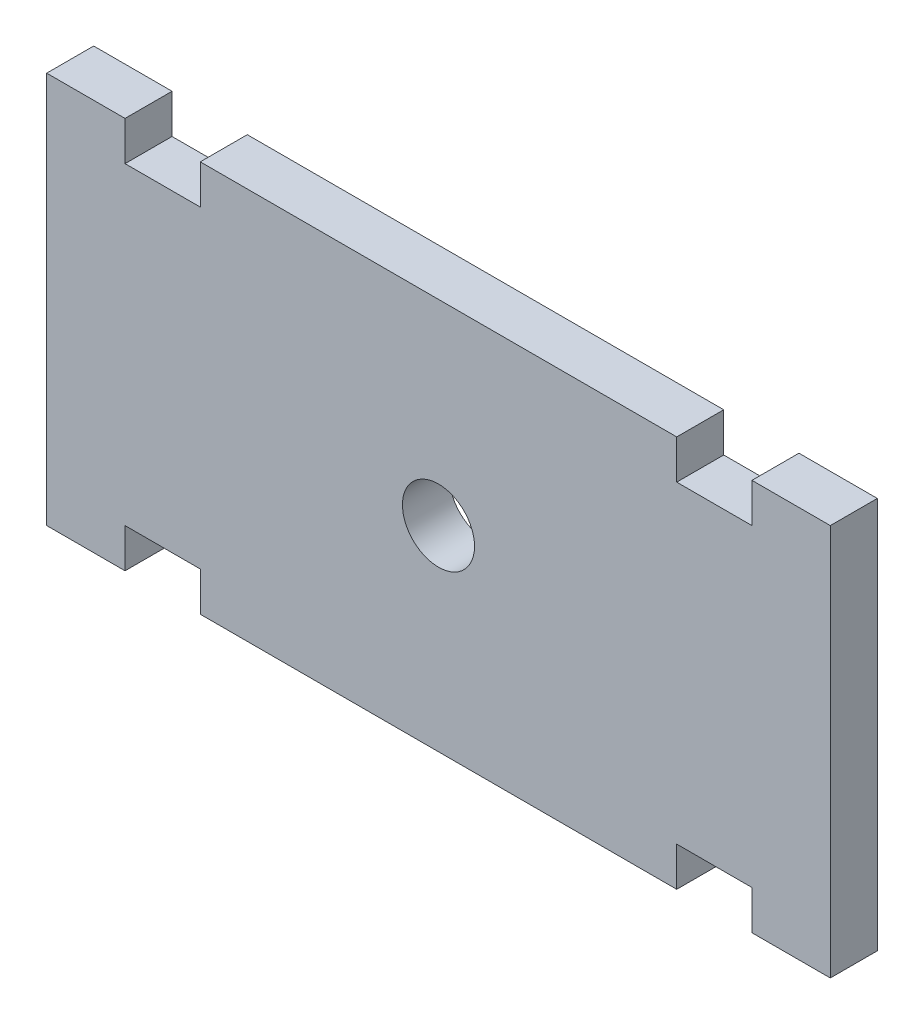
ISO-10303-21;
HEADER;
FILE_DESCRIPTION(('STEP AP214'),'2;1');
FILE_NAME('part.step','',(''),(''),'','','');
FILE_SCHEMA(('AUTOMOTIVE_DESIGN { 1 0 10303 214 1 1 1 1 }'));
ENDSEC;
DATA;
#1=APPLICATION_CONTEXT('core data for automotive mechanical design processes');
#2=APPLICATION_PROTOCOL_DEFINITION('international standard','automotive_design',2000,#1);
#3=PRODUCT_CONTEXT('',#1,'mechanical');
#4=PRODUCT('Part','Part','',(#3));
#5=PRODUCT_RELATED_PRODUCT_CATEGORY('part','',(#4));
#6=PRODUCT_DEFINITION_FORMATION('','',#4);
#7=PRODUCT_DEFINITION_CONTEXT('part definition',#1,'design');
#8=PRODUCT_DEFINITION('design','',#6,#7);
#9=PRODUCT_DEFINITION_SHAPE('','',#8);
#10=(LENGTH_UNIT() NAMED_UNIT(*) SI_UNIT(.MILLI.,.METRE.));
#11=(NAMED_UNIT(*) PLANE_ANGLE_UNIT() SI_UNIT($,.RADIAN.));
#12=(NAMED_UNIT(*) SI_UNIT($,.STERADIAN.) SOLID_ANGLE_UNIT());
#13=UNCERTAINTY_MEASURE_WITH_UNIT(LENGTH_MEASURE(1.E-05),#10,'distance_accuracy_value','');
#14=(GEOMETRIC_REPRESENTATION_CONTEXT(3) GLOBAL_UNCERTAINTY_ASSIGNED_CONTEXT((#13)) GLOBAL_UNIT_ASSIGNED_CONTEXT((#10,
#11,#12)) REPRESENTATION_CONTEXT('',''));
#15=CARTESIAN_POINT('',(0.,0.,0.));
#16=DIRECTION('',(0.,0.,1.));
#17=DIRECTION('',(1.,0.,0.));
#18=AXIS2_PLACEMENT_3D('',#15,#16,#17);
#19=CARTESIAN_POINT('',(-25.,12.5,-3.));
#20=DIRECTION('',(-1.,0.,0.));
#21=DIRECTION('',(0.,0.,1.));
#22=AXIS2_PLACEMENT_3D('',#19,#20,#21);
#23=PLANE('',#22);
#24=DIRECTION('',(0.,-1.,0.));
#25=VECTOR('',#24,1.);
#26=CARTESIAN_POINT('',(-25.,12.5,0.));
#27=LINE('',#26,#25);
#28=CARTESIAN_POINT('',(-25.,12.5,0.));
#29=VERTEX_POINT('',#28);
#30=CARTESIAN_POINT('',(-25.,-12.5,0.));
#31=VERTEX_POINT('',#30);
#32=EDGE_CURVE('E201',#29,#31,#27,.T.);
#33=ORIENTED_EDGE('',*,*,#32,.F.);
#34=DIRECTION('',(0.,0.,1.));
#35=VECTOR('',#34,1.);
#36=CARTESIAN_POINT('',(-25.,12.5,-3.));
#37=LINE('',#36,#35);
#38=CARTESIAN_POINT('',(-25.,12.5,-3.));
#39=VERTEX_POINT('',#38);
#40=EDGE_CURVE('E11',#39,#29,#37,.T.);
#41=ORIENTED_EDGE('',*,*,#40,.F.);
#42=DIRECTION('',(0.,-1.,0.));
#43=VECTOR('',#42,1.);
#44=CARTESIAN_POINT('',(-25.,12.5,-3.));
#45=LINE('',#44,#43);
#46=CARTESIAN_POINT('',(-25.,-12.5,-3.));
#47=VERTEX_POINT('',#46);
#48=EDGE_CURVE('E258',#39,#47,#45,.T.);
#49=ORIENTED_EDGE('',*,*,#48,.T.);
#50=DIRECTION('',(0.,0.,1.));
#51=VECTOR('',#50,1.);
#52=CARTESIAN_POINT('',(-25.,-12.5,-3.));
#53=LINE('',#52,#51);
#54=EDGE_CURVE('E35',#47,#31,#53,.T.);
#55=ORIENTED_EDGE('',*,*,#54,.T.);
#56=EDGE_LOOP('',(#33,#41,#49,#55));
#57=FACE_BOUND('',#56,.T.);
#58=ADVANCED_FACE('F32',(#57),#23,.T.);
#59=CARTESIAN_POINT('',(-25.,12.5,-3.));
#60=DIRECTION('',(0.,1.,0.));
#61=DIRECTION('',(0.,0.,1.));
#62=AXIS2_PLACEMENT_3D('',#59,#60,#61);
#63=PLANE('',#62);
#64=DIRECTION('',(-1.,0.,0.));
#65=VECTOR('',#64,1.);
#66=CARTESIAN_POINT('',(-25.,12.5,0.));
#67=LINE('',#66,#65);
#68=CARTESIAN_POINT('',(-20.,12.5,0.));
#69=VERTEX_POINT('',#68);
#70=EDGE_CURVE('E256',#69,#29,#67,.T.);
#71=ORIENTED_EDGE('',*,*,#70,.F.);
#72=DIRECTION('',(0.,0.,1.));
#73=VECTOR('',#72,1.);
#74=CARTESIAN_POINT('',(-20.,12.5,-3.));
#75=LINE('',#74,#73);
#76=CARTESIAN_POINT('',(-20.,12.5,-3.));
#77=VERTEX_POINT('',#76);
#78=EDGE_CURVE('E41',#77,#69,#75,.T.);
#79=ORIENTED_EDGE('',*,*,#78,.F.);
#80=DIRECTION('',(-1.,0.,0.));
#81=VECTOR('',#80,1.);
#82=CARTESIAN_POINT('',(-25.,12.5,-3.));
#83=LINE('',#82,#81);
#84=EDGE_CURVE('E191',#77,#39,#83,.T.);
#85=ORIENTED_EDGE('',*,*,#84,.T.);
#86=ORIENTED_EDGE('',*,*,#40,.T.);
#87=EDGE_LOOP('',(#71,#79,#85,#86));
#88=FACE_BOUND('',#87,.T.);
#89=ADVANCED_FACE('F294',(#88),#63,.T.);
#90=CARTESIAN_POINT('',(-20.,12.5,-3.));
#91=DIRECTION('',(1.,0.,0.));
#92=DIRECTION('',(0.,0.,-1.));
#93=AXIS2_PLACEMENT_3D('',#90,#91,#92);
#94=PLANE('',#93);
#95=DIRECTION('',(0.,1.,0.));
#96=VECTOR('',#95,1.);
#97=CARTESIAN_POINT('',(-20.,12.5,0.));
#98=LINE('',#97,#96);
#99=CARTESIAN_POINT('',(-20.,10.,0.));
#100=VERTEX_POINT('',#99);
#101=EDGE_CURVE('E178',#100,#69,#98,.T.);
#102=ORIENTED_EDGE('',*,*,#101,.F.);
#103=DIRECTION('',(0.,0.,1.));
#104=VECTOR('',#103,1.);
#105=CARTESIAN_POINT('',(-20.,10.,-3.));
#106=LINE('',#105,#104);
#107=CARTESIAN_POINT('',(-20.,10.,-3.));
#108=VERTEX_POINT('',#107);
#109=EDGE_CURVE('E173',#108,#100,#106,.T.);
#110=ORIENTED_EDGE('',*,*,#109,.F.);
#111=DIRECTION('',(0.,1.,0.));
#112=VECTOR('',#111,1.);
#113=CARTESIAN_POINT('',(-20.,12.5,-3.));
#114=LINE('',#113,#112);
#115=EDGE_CURVE('E176',#108,#77,#114,.T.);
#116=ORIENTED_EDGE('',*,*,#115,.T.);
#117=ORIENTED_EDGE('',*,*,#78,.T.);
#118=EDGE_LOOP('',(#102,#110,#116,#117));
#119=FACE_BOUND('',#118,.T.);
#120=ADVANCED_FACE('F175',(#119),#94,.T.);
#121=CARTESIAN_POINT('',(-20.,10.,-3.));
#122=DIRECTION('',(0.,1.,0.));
#123=DIRECTION('',(0.,0.,1.));
#124=AXIS2_PLACEMENT_3D('',#121,#122,#123);
#125=PLANE('',#124);
#126=DIRECTION('',(-1.,0.,0.));
#127=VECTOR('',#126,1.);
#128=CARTESIAN_POINT('',(-20.,10.,0.));
#129=LINE('',#128,#127);
#130=CARTESIAN_POINT('',(-15.2,10.,0.));
#131=VERTEX_POINT('',#130);
#132=EDGE_CURVE('E253',#131,#100,#129,.T.);
#133=ORIENTED_EDGE('',*,*,#132,.F.);
#134=DIRECTION('',(0.,0.,1.));
#135=VECTOR('',#134,1.);
#136=CARTESIAN_POINT('',(-15.2,10.,-3.));
#137=LINE('',#136,#135);
#138=CARTESIAN_POINT('',(-15.2,10.,-3.));
#139=VERTEX_POINT('',#138);
#140=EDGE_CURVE('E183',#139,#131,#137,.T.);
#141=ORIENTED_EDGE('',*,*,#140,.F.);
#142=DIRECTION('',(-1.,0.,0.));
#143=VECTOR('',#142,1.);
#144=CARTESIAN_POINT('',(-20.,10.,-3.));
#145=LINE('',#144,#143);
#146=EDGE_CURVE('E189',#139,#108,#145,.T.);
#147=ORIENTED_EDGE('',*,*,#146,.T.);
#148=ORIENTED_EDGE('',*,*,#109,.T.);
#149=EDGE_LOOP('',(#133,#141,#147,#148));
#150=FACE_BOUND('',#149,.T.);
#151=ADVANCED_FACE('F193',(#150),#125,.T.);
#152=CARTESIAN_POINT('',(-15.2,10.,-3.));
#153=DIRECTION('',(-1.,0.,0.));
#154=DIRECTION('',(0.,0.,1.));
#155=AXIS2_PLACEMENT_3D('',#152,#153,#154);
#156=PLANE('',#155);
#157=DIRECTION('',(0.,-1.,0.));
#158=VECTOR('',#157,1.);
#159=CARTESIAN_POINT('',(-15.2,10.,0.));
#160=LINE('',#159,#158);
#161=CARTESIAN_POINT('',(-15.2,12.5,0.));
#162=VERTEX_POINT('',#161);
#163=EDGE_CURVE('E250',#162,#131,#160,.T.);
#164=ORIENTED_EDGE('',*,*,#163,.F.);
#165=DIRECTION('',(0.,0.,1.));
#166=VECTOR('',#165,1.);
#167=CARTESIAN_POINT('',(-15.2,12.5,-3.));
#168=LINE('',#167,#166);
#169=CARTESIAN_POINT('',(-15.2,12.5,-3.));
#170=VERTEX_POINT('',#169);
#171=EDGE_CURVE('E262',#170,#162,#168,.T.);
#172=ORIENTED_EDGE('',*,*,#171,.F.);
#173=DIRECTION('',(0.,-1.,0.));
#174=VECTOR('',#173,1.);
#175=CARTESIAN_POINT('',(-15.2,10.,-3.));
#176=LINE('',#175,#174);
#177=EDGE_CURVE('E194',#170,#139,#176,.T.);
#178=ORIENTED_EDGE('',*,*,#177,.T.);
#179=ORIENTED_EDGE('',*,*,#140,.T.);
#180=EDGE_LOOP('',(#164,#172,#178,#179));
#181=FACE_BOUND('',#180,.T.);
#182=ADVANCED_FACE('F307',(#181),#156,.T.);
#183=CARTESIAN_POINT('',(-15.2,12.5,-3.));
#184=DIRECTION('',(0.,1.,0.));
#185=DIRECTION('',(-1.,0.,0.));
#186=AXIS2_PLACEMENT_3D('',#183,#184,#185);
#187=PLANE('',#186);
#188=DIRECTION('',(-1.,0.,0.));
#189=VECTOR('',#188,1.);
#190=CARTESIAN_POINT('',(-15.2,12.5,0.));
#191=LINE('',#190,#189);
#192=CARTESIAN_POINT('',(15.2,12.5,0.));
#193=VERTEX_POINT('',#192);
#194=EDGE_CURVE('E247',#193,#162,#191,.T.);
#195=ORIENTED_EDGE('',*,*,#194,.F.);
#196=DIRECTION('',(0.,0.,1.));
#197=VECTOR('',#196,1.);
#198=CARTESIAN_POINT('',(15.2,12.5,-3.));
#199=LINE('',#198,#197);
#200=CARTESIAN_POINT('',(15.2,12.5,-3.));
#201=VERTEX_POINT('',#200);
#202=EDGE_CURVE('E264',#201,#193,#199,.T.);
#203=ORIENTED_EDGE('',*,*,#202,.F.);
#204=DIRECTION('',(-1.,0.,0.));
#205=VECTOR('',#204,1.);
#206=CARTESIAN_POINT('',(-15.2,12.5,-3.));
#207=LINE('',#206,#205);
#208=EDGE_CURVE('E196',#201,#170,#207,.T.);
#209=ORIENTED_EDGE('',*,*,#208,.T.);
#210=ORIENTED_EDGE('',*,*,#171,.T.);
#211=EDGE_LOOP('',(#195,#203,#209,#210));
#212=FACE_BOUND('',#211,.T.);
#213=ADVANCED_FACE('F310',(#212),#187,.T.);
#214=CARTESIAN_POINT('',(15.2,10.,-3.));
#215=DIRECTION('',(1.,0.,0.));
#216=DIRECTION('',(0.,0.,-1.));
#217=AXIS2_PLACEMENT_3D('',#214,#215,#216);
#218=PLANE('',#217);
#219=DIRECTION('',(0.,1.,0.));
#220=VECTOR('',#219,1.);
#221=CARTESIAN_POINT('',(15.2,10.,0.));
#222=LINE('',#221,#220);
#223=CARTESIAN_POINT('',(15.2,10.,0.));
#224=VERTEX_POINT('',#223);
#225=EDGE_CURVE('E244',#224,#193,#222,.T.);
#226=ORIENTED_EDGE('',*,*,#225,.F.);
#227=DIRECTION('',(0.,0.,1.));
#228=VECTOR('',#227,1.);
#229=CARTESIAN_POINT('',(15.2,10.,-3.));
#230=LINE('',#229,#228);
#231=CARTESIAN_POINT('',(15.2,10.,-3.));
#232=VERTEX_POINT('',#231);
#233=EDGE_CURVE('E266',#232,#224,#230,.T.);
#234=ORIENTED_EDGE('',*,*,#233,.F.);
#235=DIRECTION('',(0.,1.,0.));
#236=VECTOR('',#235,1.);
#237=CARTESIAN_POINT('',(15.2,10.,-3.));
#238=LINE('',#237,#236);
#239=EDGE_CURVE('E429',#232,#201,#238,.T.);
#240=ORIENTED_EDGE('',*,*,#239,.T.);
#241=ORIENTED_EDGE('',*,*,#202,.T.);
#242=EDGE_LOOP('',(#226,#234,#240,#241));
#243=FACE_BOUND('',#242,.T.);
#244=ADVANCED_FACE('F314',(#243),#218,.T.);
#245=CARTESIAN_POINT('',(20.,10.,-3.));
#246=DIRECTION('',(0.,1.,0.));
#247=DIRECTION('',(0.,0.,1.));
#248=AXIS2_PLACEMENT_3D('',#245,#246,#247);
#249=PLANE('',#248);
#250=DIRECTION('',(-1.,0.,0.));
#251=VECTOR('',#250,1.);
#252=CARTESIAN_POINT('',(20.,10.,0.));
#253=LINE('',#252,#251);
#254=CARTESIAN_POINT('',(20.,10.,0.));
#255=VERTEX_POINT('',#254);
#256=EDGE_CURVE('E241',#255,#224,#253,.T.);
#257=ORIENTED_EDGE('',*,*,#256,.F.);
#258=DIRECTION('',(0.,0.,1.));
#259=VECTOR('',#258,1.);
#260=CARTESIAN_POINT('',(20.,10.,-3.));
#261=LINE('',#260,#259);
#262=CARTESIAN_POINT('',(20.,10.,-3.));
#263=VERTEX_POINT('',#262);
#264=EDGE_CURVE('E268',#263,#255,#261,.T.);
#265=ORIENTED_EDGE('',*,*,#264,.F.);
#266=DIRECTION('',(-1.,0.,0.));
#267=VECTOR('',#266,1.);
#268=CARTESIAN_POINT('',(20.,10.,-3.));
#269=LINE('',#268,#267);
#270=EDGE_CURVE('E426',#263,#232,#269,.T.);
#271=ORIENTED_EDGE('',*,*,#270,.T.);
#272=ORIENTED_EDGE('',*,*,#233,.T.);
#273=EDGE_LOOP('',(#257,#265,#271,#272));
#274=FACE_BOUND('',#273,.T.);
#275=ADVANCED_FACE('F318',(#274),#249,.T.);
#276=CARTESIAN_POINT('',(20.,12.5,-3.));
#277=DIRECTION('',(-1.,0.,0.));
#278=DIRECTION('',(0.,0.,1.));
#279=AXIS2_PLACEMENT_3D('',#276,#277,#278);
#280=PLANE('',#279);
#281=DIRECTION('',(0.,-1.,0.));
#282=VECTOR('',#281,1.);
#283=CARTESIAN_POINT('',(20.,12.5,0.));
#284=LINE('',#283,#282);
#285=CARTESIAN_POINT('',(20.,12.5,0.));
#286=VERTEX_POINT('',#285);
#287=EDGE_CURVE('E238',#286,#255,#284,.T.);
#288=ORIENTED_EDGE('',*,*,#287,.F.);
#289=DIRECTION('',(0.,0.,1.));
#290=VECTOR('',#289,1.);
#291=CARTESIAN_POINT('',(20.,12.5,-3.));
#292=LINE('',#291,#290);
#293=CARTESIAN_POINT('',(20.,12.5,-3.));
#294=VERTEX_POINT('',#293);
#295=EDGE_CURVE('E270',#294,#286,#292,.T.);
#296=ORIENTED_EDGE('',*,*,#295,.F.);
#297=DIRECTION('',(0.,-1.,0.));
#298=VECTOR('',#297,1.);
#299=CARTESIAN_POINT('',(20.,12.5,-3.));
#300=LINE('',#299,#298);
#301=EDGE_CURVE('E423',#294,#263,#300,.T.);
#302=ORIENTED_EDGE('',*,*,#301,.T.);
#303=ORIENTED_EDGE('',*,*,#264,.T.);
#304=EDGE_LOOP('',(#288,#296,#302,#303));
#305=FACE_BOUND('',#304,.T.);
#306=ADVANCED_FACE('F322',(#305),#280,.T.);
#307=CARTESIAN_POINT('',(25.,12.5,-3.));
#308=DIRECTION('',(0.,1.,0.));
#309=DIRECTION('',(0.,0.,1.));
#310=AXIS2_PLACEMENT_3D('',#307,#308,#309);
#311=PLANE('',#310);
#312=DIRECTION('',(-1.,0.,0.));
#313=VECTOR('',#312,1.);
#314=CARTESIAN_POINT('',(25.,12.5,0.));
#315=LINE('',#314,#313);
#316=CARTESIAN_POINT('',(25.,12.5,0.));
#317=VERTEX_POINT('',#316);
#318=EDGE_CURVE('E235',#317,#286,#315,.T.);
#319=ORIENTED_EDGE('',*,*,#318,.F.);
#320=DIRECTION('',(0.,0.,1.));
#321=VECTOR('',#320,1.);
#322=CARTESIAN_POINT('',(25.,12.5,-3.));
#323=LINE('',#322,#321);
#324=CARTESIAN_POINT('',(25.,12.5,-3.));
#325=VERTEX_POINT('',#324);
#326=EDGE_CURVE('E272',#325,#317,#323,.T.);
#327=ORIENTED_EDGE('',*,*,#326,.F.);
#328=DIRECTION('',(-1.,0.,0.));
#329=VECTOR('',#328,1.);
#330=CARTESIAN_POINT('',(25.,12.5,-3.));
#331=LINE('',#330,#329);
#332=EDGE_CURVE('E420',#325,#294,#331,.T.);
#333=ORIENTED_EDGE('',*,*,#332,.T.);
#334=ORIENTED_EDGE('',*,*,#295,.T.);
#335=EDGE_LOOP('',(#319,#327,#333,#334));
#336=FACE_BOUND('',#335,.T.);
#337=ADVANCED_FACE('F326',(#336),#311,.T.);
#338=CARTESIAN_POINT('',(25.,12.5,-3.));
#339=DIRECTION('',(1.,0.,0.));
#340=DIRECTION('',(0.,0.,-1.));
#341=AXIS2_PLACEMENT_3D('',#338,#339,#340);
#342=PLANE('',#341);
#343=DIRECTION('',(0.,1.,0.));
#344=VECTOR('',#343,1.);
#345=CARTESIAN_POINT('',(25.,12.5,0.));
#346=LINE('',#345,#344);
#347=CARTESIAN_POINT('',(25.,-12.5,0.));
#348=VERTEX_POINT('',#347);
#349=EDGE_CURVE('E232',#348,#317,#346,.T.);
#350=ORIENTED_EDGE('',*,*,#349,.F.);
#351=DIRECTION('',(0.,0.,1.));
#352=VECTOR('',#351,1.);
#353=CARTESIAN_POINT('',(25.,-12.5,-3.));
#354=LINE('',#353,#352);
#355=CARTESIAN_POINT('',(25.,-12.5,-3.));
#356=VERTEX_POINT('',#355);
#357=EDGE_CURVE('E274',#356,#348,#354,.T.);
#358=ORIENTED_EDGE('',*,*,#357,.F.);
#359=DIRECTION('',(0.,1.,0.));
#360=VECTOR('',#359,1.);
#361=CARTESIAN_POINT('',(25.,12.5,-3.));
#362=LINE('',#361,#360);
#363=EDGE_CURVE('E417',#356,#325,#362,.T.);
#364=ORIENTED_EDGE('',*,*,#363,.T.);
#365=ORIENTED_EDGE('',*,*,#326,.T.);
#366=EDGE_LOOP('',(#350,#358,#364,#365));
#367=FACE_BOUND('',#366,.T.);
#368=ADVANCED_FACE('F330',(#367),#342,.T.);
#369=CARTESIAN_POINT('',(25.,-12.5,-3.));
#370=DIRECTION('',(0.,-1.,0.));
#371=DIRECTION('',(1.,0.,0.));
#372=AXIS2_PLACEMENT_3D('',#369,#370,#371);
#373=PLANE('',#372);
#374=DIRECTION('',(1.,0.,0.));
#375=VECTOR('',#374,1.);
#376=CARTESIAN_POINT('',(25.,-12.5,0.));
#377=LINE('',#376,#375);
#378=CARTESIAN_POINT('',(20.,-12.5,0.));
#379=VERTEX_POINT('',#378);
#380=EDGE_CURVE('E229',#379,#348,#377,.T.);
#381=ORIENTED_EDGE('',*,*,#380,.F.);
#382=DIRECTION('',(0.,0.,1.));
#383=VECTOR('',#382,1.);
#384=CARTESIAN_POINT('',(20.,-12.5,-3.));
#385=LINE('',#384,#383);
#386=CARTESIAN_POINT('',(20.,-12.5,-3.));
#387=VERTEX_POINT('',#386);
#388=EDGE_CURVE('E276',#387,#379,#385,.T.);
#389=ORIENTED_EDGE('',*,*,#388,.F.);
#390=DIRECTION('',(1.,0.,0.));
#391=VECTOR('',#390,1.);
#392=CARTESIAN_POINT('',(25.,-12.5,-3.));
#393=LINE('',#392,#391);
#394=EDGE_CURVE('E414',#387,#356,#393,.T.);
#395=ORIENTED_EDGE('',*,*,#394,.T.);
#396=ORIENTED_EDGE('',*,*,#357,.T.);
#397=EDGE_LOOP('',(#381,#389,#395,#396));
#398=FACE_BOUND('',#397,.T.);
#399=ADVANCED_FACE('F334',(#398),#373,.T.);
#400=CARTESIAN_POINT('',(20.,-12.5,-3.));
#401=DIRECTION('',(-1.,0.,0.));
#402=DIRECTION('',(0.,-1.,0.));
#403=AXIS2_PLACEMENT_3D('',#400,#401,#402);
#404=PLANE('',#403);
#405=DIRECTION('',(0.,-1.,0.));
#406=VECTOR('',#405,1.);
#407=CARTESIAN_POINT('',(20.,-12.5,0.));
#408=LINE('',#407,#406);
#409=CARTESIAN_POINT('',(20.,-9.99999999999998,0.));
#410=VERTEX_POINT('',#409);
#411=EDGE_CURVE('E226',#410,#379,#408,.T.);
#412=ORIENTED_EDGE('',*,*,#411,.F.);
#413=DIRECTION('',(0.,0.,1.));
#414=VECTOR('',#413,1.);
#415=CARTESIAN_POINT('',(20.,-9.99999999999998,-3.));
#416=LINE('',#415,#414);
#417=CARTESIAN_POINT('',(20.,-9.99999999999998,-3.));
#418=VERTEX_POINT('',#417);
#419=EDGE_CURVE('E278',#418,#410,#416,.T.);
#420=ORIENTED_EDGE('',*,*,#419,.F.);
#421=DIRECTION('',(0.,-1.,0.));
#422=VECTOR('',#421,1.);
#423=CARTESIAN_POINT('',(20.,-12.5,-3.));
#424=LINE('',#423,#422);
#425=EDGE_CURVE('E411',#418,#387,#424,.T.);
#426=ORIENTED_EDGE('',*,*,#425,.T.);
#427=ORIENTED_EDGE('',*,*,#388,.T.);
#428=EDGE_LOOP('',(#412,#420,#426,#427));
#429=FACE_BOUND('',#428,.T.);
#430=ADVANCED_FACE('F338',(#429),#404,.T.);
#431=CARTESIAN_POINT('',(20.,-9.99999999999998,-3.));
#432=DIRECTION('',(0.,-1.,0.));
#433=DIRECTION('',(0.,0.,-1.));
#434=AXIS2_PLACEMENT_3D('',#431,#432,#433);
#435=PLANE('',#434);
#436=DIRECTION('',(1.,0.,0.));
#437=VECTOR('',#436,1.);
#438=CARTESIAN_POINT('',(20.,-9.99999999999998,0.));
#439=LINE('',#438,#437);
#440=CARTESIAN_POINT('',(15.2,-9.99999999999998,0.));
#441=VERTEX_POINT('',#440);
#442=EDGE_CURVE('E223',#441,#410,#439,.T.);
#443=ORIENTED_EDGE('',*,*,#442,.F.);
#444=DIRECTION('',(0.,0.,1.));
#445=VECTOR('',#444,1.);
#446=CARTESIAN_POINT('',(15.2,-9.99999999999998,-3.));
#447=LINE('',#446,#445);
#448=CARTESIAN_POINT('',(15.2,-9.99999999999998,-3.));
#449=VERTEX_POINT('',#448);
#450=EDGE_CURVE('E280',#449,#441,#447,.T.);
#451=ORIENTED_EDGE('',*,*,#450,.F.);
#452=DIRECTION('',(1.,0.,0.));
#453=VECTOR('',#452,1.);
#454=CARTESIAN_POINT('',(20.,-9.99999999999998,-3.));
#455=LINE('',#454,#453);
#456=EDGE_CURVE('E408',#449,#418,#455,.T.);
#457=ORIENTED_EDGE('',*,*,#456,.T.);
#458=ORIENTED_EDGE('',*,*,#419,.T.);
#459=EDGE_LOOP('',(#443,#451,#457,#458));
#460=FACE_BOUND('',#459,.T.);
#461=ADVANCED_FACE('F342',(#460),#435,.T.);
#462=CARTESIAN_POINT('',(15.2,-9.99999999999998,-3.));
#463=DIRECTION('',(1.,0.,0.));
#464=DIRECTION('',(0.,0.,-1.));
#465=AXIS2_PLACEMENT_3D('',#462,#463,#464);
#466=PLANE('',#465);
#467=DIRECTION('',(0.,1.,0.));
#468=VECTOR('',#467,1.);
#469=CARTESIAN_POINT('',(15.2,-9.99999999999998,0.));
#470=LINE('',#469,#468);
#471=CARTESIAN_POINT('',(15.2,-12.5,0.));
#472=VERTEX_POINT('',#471);
#473=EDGE_CURVE('E220',#472,#441,#470,.T.);
#474=ORIENTED_EDGE('',*,*,#473,.F.);
#475=DIRECTION('',(0.,0.,1.));
#476=VECTOR('',#475,1.);
#477=CARTESIAN_POINT('',(15.2,-12.5,-3.));
#478=LINE('',#477,#476);
#479=CARTESIAN_POINT('',(15.2,-12.5,-3.));
#480=VERTEX_POINT('',#479);
#481=EDGE_CURVE('E282',#480,#472,#478,.T.);
#482=ORIENTED_EDGE('',*,*,#481,.F.);
#483=DIRECTION('',(0.,1.,0.));
#484=VECTOR('',#483,1.);
#485=CARTESIAN_POINT('',(15.2,-9.99999999999998,-3.));
#486=LINE('',#485,#484);
#487=EDGE_CURVE('E405',#480,#449,#486,.T.);
#488=ORIENTED_EDGE('',*,*,#487,.T.);
#489=ORIENTED_EDGE('',*,*,#450,.T.);
#490=EDGE_LOOP('',(#474,#482,#488,#489));
#491=FACE_BOUND('',#490,.T.);
#492=ADVANCED_FACE('F346',(#491),#466,.T.);
#493=CARTESIAN_POINT('',(-15.2,-12.5,-3.));
#494=DIRECTION('',(0.,-1.,0.));
#495=DIRECTION('',(0.,0.,-1.));
#496=AXIS2_PLACEMENT_3D('',#493,#494,#495);
#497=PLANE('',#496);
#498=DIRECTION('',(1.,0.,0.));
#499=VECTOR('',#498,1.);
#500=CARTESIAN_POINT('',(-15.2,-12.5,0.));
#501=LINE('',#500,#499);
#502=CARTESIAN_POINT('',(-15.2,-12.5,0.));
#503=VERTEX_POINT('',#502);
#504=EDGE_CURVE('E217',#503,#472,#501,.T.);
#505=ORIENTED_EDGE('',*,*,#504,.F.);
#506=DIRECTION('',(0.,0.,1.));
#507=VECTOR('',#506,1.);
#508=CARTESIAN_POINT('',(-15.2,-12.5,-3.));
#509=LINE('',#508,#507);
#510=CARTESIAN_POINT('',(-15.2,-12.5,-3.));
#511=VERTEX_POINT('',#510);
#512=EDGE_CURVE('E284',#511,#503,#509,.T.);
#513=ORIENTED_EDGE('',*,*,#512,.F.);
#514=DIRECTION('',(1.,0.,0.));
#515=VECTOR('',#514,1.);
#516=CARTESIAN_POINT('',(-15.2,-12.5,-3.));
#517=LINE('',#516,#515);
#518=EDGE_CURVE('E402',#511,#480,#517,.T.);
#519=ORIENTED_EDGE('',*,*,#518,.T.);
#520=ORIENTED_EDGE('',*,*,#481,.T.);
#521=EDGE_LOOP('',(#505,#513,#519,#520));
#522=FACE_BOUND('',#521,.T.);
#523=ADVANCED_FACE('F350',(#522),#497,.T.);
#524=CARTESIAN_POINT('',(-15.2,-9.99999999999998,-3.));
#525=DIRECTION('',(-1.,0.,0.));
#526=DIRECTION('',(0.,0.,1.));
#527=AXIS2_PLACEMENT_3D('',#524,#525,#526);
#528=PLANE('',#527);
#529=DIRECTION('',(0.,-1.,0.));
#530=VECTOR('',#529,1.);
#531=CARTESIAN_POINT('',(-15.2,-9.99999999999998,0.));
#532=LINE('',#531,#530);
#533=CARTESIAN_POINT('',(-15.2,-9.99999999999998,0.));
#534=VERTEX_POINT('',#533);
#535=EDGE_CURVE('E214',#534,#503,#532,.T.);
#536=ORIENTED_EDGE('',*,*,#535,.F.);
#537=DIRECTION('',(0.,0.,1.));
#538=VECTOR('',#537,1.);
#539=CARTESIAN_POINT('',(-15.2,-9.99999999999998,-3.));
#540=LINE('',#539,#538);
#541=CARTESIAN_POINT('',(-15.2,-9.99999999999998,-3.));
#542=VERTEX_POINT('',#541);
#543=EDGE_CURVE('E286',#542,#534,#540,.T.);
#544=ORIENTED_EDGE('',*,*,#543,.F.);
#545=DIRECTION('',(0.,-1.,0.));
#546=VECTOR('',#545,1.);
#547=CARTESIAN_POINT('',(-15.2,-9.99999999999998,-3.));
#548=LINE('',#547,#546);
#549=EDGE_CURVE('E399',#542,#511,#548,.T.);
#550=ORIENTED_EDGE('',*,*,#549,.T.);
#551=ORIENTED_EDGE('',*,*,#512,.T.);
#552=EDGE_LOOP('',(#536,#544,#550,#551));
#553=FACE_BOUND('',#552,.T.);
#554=ADVANCED_FACE('F354',(#553),#528,.T.);
#555=CARTESIAN_POINT('',(-20.,-9.99999999999998,-3.));
#556=DIRECTION('',(0.,-1.,0.));
#557=DIRECTION('',(0.,0.,-1.));
#558=AXIS2_PLACEMENT_3D('',#555,#556,#557);
#559=PLANE('',#558);
#560=DIRECTION('',(1.,0.,0.));
#561=VECTOR('',#560,1.);
#562=CARTESIAN_POINT('',(-20.,-9.99999999999998,0.));
#563=LINE('',#562,#561);
#564=CARTESIAN_POINT('',(-20.,-9.99999999999998,0.));
#565=VERTEX_POINT('',#564);
#566=EDGE_CURVE('E211',#565,#534,#563,.T.);
#567=ORIENTED_EDGE('',*,*,#566,.F.);
#568=DIRECTION('',(0.,0.,1.));
#569=VECTOR('',#568,1.);
#570=CARTESIAN_POINT('',(-20.,-9.99999999999998,-3.));
#571=LINE('',#570,#569);
#572=CARTESIAN_POINT('',(-20.,-9.99999999999998,-3.));
#573=VERTEX_POINT('',#572);
#574=EDGE_CURVE('E288',#573,#565,#571,.T.);
#575=ORIENTED_EDGE('',*,*,#574,.F.);
#576=DIRECTION('',(1.,0.,0.));
#577=VECTOR('',#576,1.);
#578=CARTESIAN_POINT('',(-20.,-9.99999999999998,-3.));
#579=LINE('',#578,#577);
#580=EDGE_CURVE('E396',#573,#542,#579,.T.);
#581=ORIENTED_EDGE('',*,*,#580,.T.);
#582=ORIENTED_EDGE('',*,*,#543,.T.);
#583=EDGE_LOOP('',(#567,#575,#581,#582));
#584=FACE_BOUND('',#583,.T.);
#585=ADVANCED_FACE('F358',(#584),#559,.T.);
#586=CARTESIAN_POINT('',(-20.,-12.5,-3.));
#587=DIRECTION('',(1.,0.,0.));
#588=DIRECTION('',(0.,1.,0.));
#589=AXIS2_PLACEMENT_3D('',#586,#587,#588);
#590=PLANE('',#589);
#591=DIRECTION('',(0.,1.,0.));
#592=VECTOR('',#591,1.);
#593=CARTESIAN_POINT('',(-20.,-12.5,0.));
#594=LINE('',#593,#592);
#595=CARTESIAN_POINT('',(-20.,-12.5,0.));
#596=VERTEX_POINT('',#595);
#597=EDGE_CURVE('E208',#596,#565,#594,.T.);
#598=ORIENTED_EDGE('',*,*,#597,.F.);
#599=DIRECTION('',(0.,0.,1.));
#600=VECTOR('',#599,1.);
#601=CARTESIAN_POINT('',(-20.,-12.5,-3.));
#602=LINE('',#601,#600);
#603=CARTESIAN_POINT('',(-20.,-12.5,-3.));
#604=VERTEX_POINT('',#603);
#605=EDGE_CURVE('E289',#604,#596,#602,.T.);
#606=ORIENTED_EDGE('',*,*,#605,.F.);
#607=DIRECTION('',(0.,1.,0.));
#608=VECTOR('',#607,1.);
#609=CARTESIAN_POINT('',(-20.,-12.5,-3.));
#610=LINE('',#609,#608);
#611=EDGE_CURVE('E393',#604,#573,#610,.T.);
#612=ORIENTED_EDGE('',*,*,#611,.T.);
#613=ORIENTED_EDGE('',*,*,#574,.T.);
#614=EDGE_LOOP('',(#598,#606,#612,#613));
#615=FACE_BOUND('',#614,.T.);
#616=ADVANCED_FACE('F362',(#615),#590,.T.);
#617=CARTESIAN_POINT('',(-25.,-12.5,-3.));
#618=DIRECTION('',(0.,-1.,0.));
#619=DIRECTION('',(1.,0.,0.));
#620=AXIS2_PLACEMENT_3D('',#617,#618,#619);
#621=PLANE('',#620);
#622=DIRECTION('',(1.,0.,0.));
#623=VECTOR('',#622,1.);
#624=CARTESIAN_POINT('',(-25.,-12.5,0.));
#625=LINE('',#624,#623);
#626=EDGE_CURVE('E204',#31,#596,#625,.T.);
#627=ORIENTED_EDGE('',*,*,#626,.F.);
#628=ORIENTED_EDGE('',*,*,#54,.F.);
#629=DIRECTION('',(1.,0.,0.));
#630=VECTOR('',#629,1.);
#631=CARTESIAN_POINT('',(-25.,-12.5,-3.));
#632=LINE('',#631,#630);
#633=EDGE_CURVE('E391',#47,#604,#632,.T.);
#634=ORIENTED_EDGE('',*,*,#633,.T.);
#635=ORIENTED_EDGE('',*,*,#605,.T.);
#636=EDGE_LOOP('',(#627,#628,#634,#635));
#637=FACE_BOUND('',#636,.T.);
#638=ADVANCED_FACE('F291',(#637),#621,.T.);
#639=CARTESIAN_POINT('',(0.,0.,-3.));
#640=DIRECTION('',(0.,0.,1.));
#641=DIRECTION('',(1.,0.,0.));
#642=AXIS2_PLACEMENT_3D('',#639,#640,#641);
#643=PLANE('',#642);
#644=CARTESIAN_POINT('',(0.,0.,-3.));
#645=DIRECTION('',(0.,0.,1.));
#646=DIRECTION('',(1.,0.,0.));
#647=AXIS2_PLACEMENT_3D('',#644,#645,#646);
#648=CIRCLE('',#647,2.29999999999999);
#649=CARTESIAN_POINT('',(2.29999999999999,0.,-3.));
#650=VERTEX_POINT('',#649);
#651=EDGE_CURVE('E205',#650,#650,#648,.T.);
#652=ORIENTED_EDGE('',*,*,#651,.T.);
#653=EDGE_LOOP('',(#652));
#654=FACE_BOUND('',#653,.T.);
#655=ORIENTED_EDGE('',*,*,#48,.F.);
#656=ORIENTED_EDGE('',*,*,#84,.F.);
#657=ORIENTED_EDGE('',*,*,#115,.F.);
#658=ORIENTED_EDGE('',*,*,#146,.F.);
#659=ORIENTED_EDGE('',*,*,#177,.F.);
#660=ORIENTED_EDGE('',*,*,#208,.F.);
#661=ORIENTED_EDGE('',*,*,#239,.F.);
#662=ORIENTED_EDGE('',*,*,#270,.F.);
#663=ORIENTED_EDGE('',*,*,#301,.F.);
#664=ORIENTED_EDGE('',*,*,#332,.F.);
#665=ORIENTED_EDGE('',*,*,#363,.F.);
#666=ORIENTED_EDGE('',*,*,#394,.F.);
#667=ORIENTED_EDGE('',*,*,#425,.F.);
#668=ORIENTED_EDGE('',*,*,#456,.F.);
#669=ORIENTED_EDGE('',*,*,#487,.F.);
#670=ORIENTED_EDGE('',*,*,#518,.F.);
#671=ORIENTED_EDGE('',*,*,#549,.F.);
#672=ORIENTED_EDGE('',*,*,#580,.F.);
#673=ORIENTED_EDGE('',*,*,#611,.F.);
#674=ORIENTED_EDGE('',*,*,#633,.F.);
#675=EDGE_LOOP('',(#655,#656,#657,#658,#659,#660,#661,#662,#663,#664,#665,#666,#667,#668,#669,
#670,#671,#672,#673,#674));
#676=FACE_BOUND('',#675,.T.);
#677=ADVANCED_FACE('F187',(#654,#676),#643,.F.);
#678=CARTESIAN_POINT('',(0.,0.,0.));
#679=DIRECTION('',(0.,0.,1.));
#680=DIRECTION('',(1.,0.,0.));
#681=AXIS2_PLACEMENT_3D('',#678,#679,#680);
#682=PLANE('',#681);
#683=CARTESIAN_POINT('',(0.,0.,0.));
#684=DIRECTION('',(0.,0.,1.));
#685=DIRECTION('',(1.,0.,0.));
#686=AXIS2_PLACEMENT_3D('',#683,#684,#685);
#687=CIRCLE('',#686,2.29999999999999);
#688=CARTESIAN_POINT('',(2.29999999999999,0.,0.));
#689=VERTEX_POINT('',#688);
#690=EDGE_CURVE('E386',#689,#689,#687,.T.);
#691=ORIENTED_EDGE('',*,*,#690,.F.);
#692=EDGE_LOOP('',(#691));
#693=FACE_BOUND('',#692,.T.);
#694=ORIENTED_EDGE('',*,*,#32,.T.);
#695=ORIENTED_EDGE('',*,*,#626,.T.);
#696=ORIENTED_EDGE('',*,*,#597,.T.);
#697=ORIENTED_EDGE('',*,*,#566,.T.);
#698=ORIENTED_EDGE('',*,*,#535,.T.);
#699=ORIENTED_EDGE('',*,*,#504,.T.);
#700=ORIENTED_EDGE('',*,*,#473,.T.);
#701=ORIENTED_EDGE('',*,*,#442,.T.);
#702=ORIENTED_EDGE('',*,*,#411,.T.);
#703=ORIENTED_EDGE('',*,*,#380,.T.);
#704=ORIENTED_EDGE('',*,*,#349,.T.);
#705=ORIENTED_EDGE('',*,*,#318,.T.);
#706=ORIENTED_EDGE('',*,*,#287,.T.);
#707=ORIENTED_EDGE('',*,*,#256,.T.);
#708=ORIENTED_EDGE('',*,*,#225,.T.);
#709=ORIENTED_EDGE('',*,*,#194,.T.);
#710=ORIENTED_EDGE('',*,*,#163,.T.);
#711=ORIENTED_EDGE('',*,*,#132,.T.);
#712=ORIENTED_EDGE('',*,*,#101,.T.);
#713=ORIENTED_EDGE('',*,*,#70,.T.);
#714=EDGE_LOOP('',(#694,#695,#696,#697,#698,#699,#700,#701,#702,#703,#704,#705,#706,#707,#708,
#709,#710,#711,#712,#713));
#715=FACE_BOUND('',#714,.T.);
#716=ADVANCED_FACE('F293',(#693,#715),#682,.T.);
#717=CARTESIAN_POINT('',(0.,0.,-3.));
#718=DIRECTION('',(0.,0.,1.));
#719=DIRECTION('',(1.,0.,0.));
#720=AXIS2_PLACEMENT_3D('',#717,#718,#719);
#721=CYLINDRICAL_SURFACE('',#720,2.29999999999999);
#722=ORIENTED_EDGE('',*,*,#651,.F.);
#723=EDGE_LOOP('',(#722));
#724=FACE_BOUND('',#723,.T.);
#725=ORIENTED_EDGE('',*,*,#690,.T.);
#726=EDGE_LOOP('',(#725));
#727=FACE_BOUND('',#726,.T.);
#728=ADVANCED_FACE('F374',(#724,#727),#721,.F.);
#729=CLOSED_SHELL('',(#58,#89,#120,#151,#182,#213,#244,#275,#306,#337,#368,#399,#430,#461,#492,
#523,#554,#585,#616,#638,#677,#716,#728));
#730=MANIFOLD_SOLID_BREP('B2',#729);
#731=ADVANCED_BREP_SHAPE_REPRESENTATION('',(#18,#730),#14);
#732=SHAPE_DEFINITION_REPRESENTATION(#9,#731);
ENDSEC;
END-ISO-10303-21;
